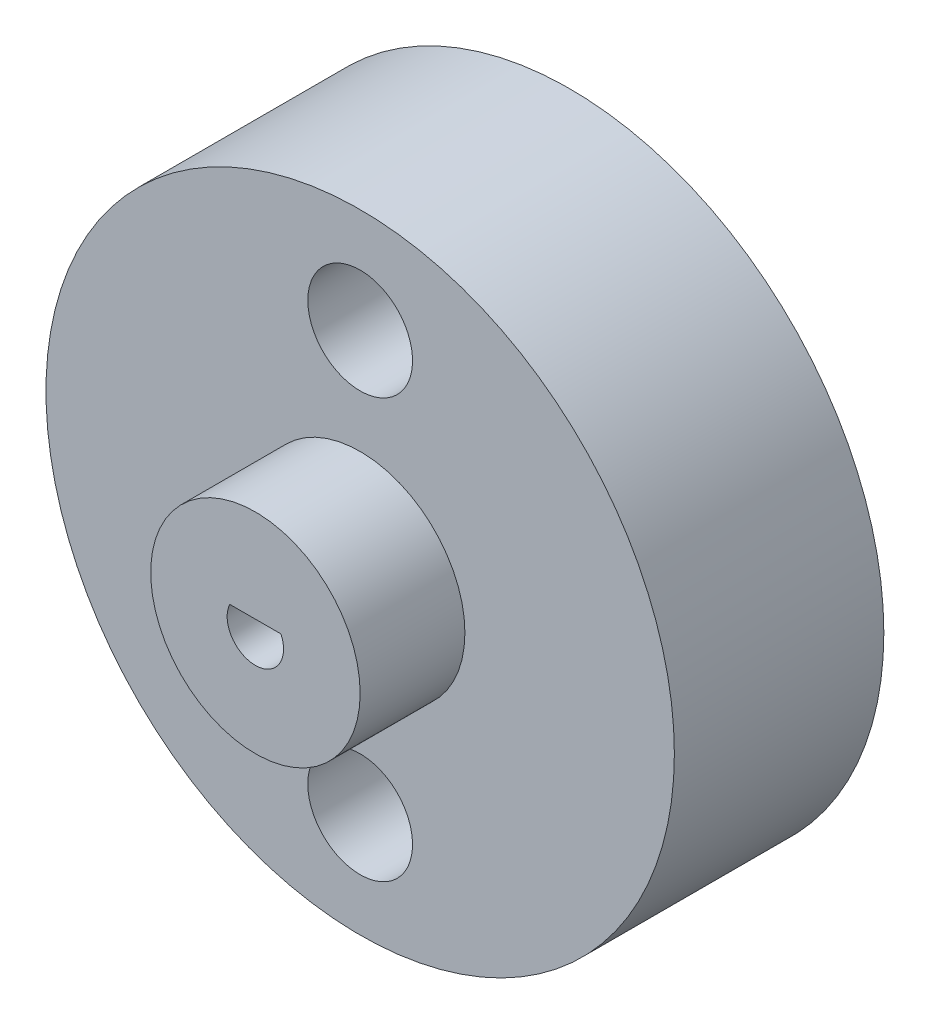
ISO-10303-21;
HEADER;
FILE_DESCRIPTION(('STEP AP214'),'2;1');
FILE_NAME('part.step','',(''),(''),'','','');
FILE_SCHEMA(('AUTOMOTIVE_DESIGN { 1 0 10303 214 1 1 1 1 }'));
ENDSEC;
DATA;
#1=APPLICATION_CONTEXT('core data for automotive mechanical design processes');
#2=APPLICATION_PROTOCOL_DEFINITION('international standard','automotive_design',2000,#1);
#3=PRODUCT_CONTEXT('',#1,'mechanical');
#4=PRODUCT('Part','Part','',(#3));
#5=PRODUCT_RELATED_PRODUCT_CATEGORY('part','',(#4));
#6=PRODUCT_DEFINITION_FORMATION('','',#4);
#7=PRODUCT_DEFINITION_CONTEXT('part definition',#1,'design');
#8=PRODUCT_DEFINITION('design','',#6,#7);
#9=PRODUCT_DEFINITION_SHAPE('','',#8);
#10=(LENGTH_UNIT() NAMED_UNIT(*) SI_UNIT(.MILLI.,.METRE.));
#11=(NAMED_UNIT(*) PLANE_ANGLE_UNIT() SI_UNIT($,.RADIAN.));
#12=(NAMED_UNIT(*) SI_UNIT($,.STERADIAN.) SOLID_ANGLE_UNIT());
#13=UNCERTAINTY_MEASURE_WITH_UNIT(LENGTH_MEASURE(1.E-05),#10,'distance_accuracy_value','');
#14=(GEOMETRIC_REPRESENTATION_CONTEXT(3) GLOBAL_UNCERTAINTY_ASSIGNED_CONTEXT((#13)) GLOBAL_UNIT_ASSIGNED_CONTEXT((#10,
#11,#12)) REPRESENTATION_CONTEXT('',''));
#15=CARTESIAN_POINT('',(0.,0.,0.));
#16=DIRECTION('',(0.,0.,1.));
#17=DIRECTION('',(1.,0.,0.));
#18=AXIS2_PLACEMENT_3D('',#15,#16,#17);
#19=CARTESIAN_POINT('',(0.,0.,12.7));
#20=DIRECTION('',(0.,0.,-1.));
#21=DIRECTION('',(-1.,0.,0.));
#22=AXIS2_PLACEMENT_3D('',#19,#20,#21);
#23=CYLINDRICAL_SURFACE('',#22,19.05);
#24=CARTESIAN_POINT('',(0.,0.,12.7));
#25=DIRECTION('',(0.,0.,1.));
#26=DIRECTION('',(1.,0.,0.));
#27=AXIS2_PLACEMENT_3D('',#24,#25,#26);
#28=CIRCLE('',#27,19.05);
#29=CARTESIAN_POINT('',(19.05,0.,12.7));
#30=VERTEX_POINT('',#29);
#31=EDGE_CURVE('E52',#30,#30,#28,.T.);
#32=ORIENTED_EDGE('',*,*,#31,.F.);
#33=EDGE_LOOP('',(#32));
#34=FACE_BOUND('',#33,.T.);
#35=CARTESIAN_POINT('',(0.,0.,0.));
#36=DIRECTION('',(0.,0.,1.));
#37=DIRECTION('',(1.,0.,0.));
#38=AXIS2_PLACEMENT_3D('',#35,#36,#37);
#39=CIRCLE('',#38,19.05);
#40=CARTESIAN_POINT('',(19.05,0.,0.));
#41=VERTEX_POINT('',#40);
#42=EDGE_CURVE('E47',#41,#41,#39,.T.);
#43=ORIENTED_EDGE('',*,*,#42,.T.);
#44=EDGE_LOOP('',(#43));
#45=FACE_BOUND('',#44,.T.);
#46=ADVANCED_FACE('F44',(#34,#45),#23,.T.);
#47=CARTESIAN_POINT('',(0.,0.,12.7));
#48=DIRECTION('',(0.,0.,1.));
#49=DIRECTION('',(1.,0.,0.));
#50=AXIS2_PLACEMENT_3D('',#47,#48,#49);
#51=PLANE('',#50);
#52=CARTESIAN_POINT('',(0.,0.,12.7));
#53=DIRECTION('',(0.,0.,1.));
#54=DIRECTION('',(1.,0.,0.));
#55=AXIS2_PLACEMENT_3D('',#52,#53,#54);
#56=CIRCLE('',#55,6.35);
#57=CARTESIAN_POINT('',(6.35,0.,12.7));
#58=VERTEX_POINT('',#57);
#59=EDGE_CURVE('E13',#58,#58,#56,.T.);
#60=ORIENTED_EDGE('',*,*,#59,.F.);
#61=EDGE_LOOP('',(#60));
#62=FACE_BOUND('',#61,.T.);
#63=CARTESIAN_POINT('',(0.,12.7,12.7));
#64=DIRECTION('',(0.,0.,-1.));
#65=DIRECTION('',(-1.,0.,0.));
#66=AXIS2_PLACEMENT_3D('',#63,#64,#65);
#67=CIRCLE('',#66,3.175);
#68=CARTESIAN_POINT('',(-3.175,12.7,12.7));
#69=VERTEX_POINT('',#68);
#70=EDGE_CURVE('E95',#69,#69,#67,.T.);
#71=ORIENTED_EDGE('',*,*,#70,.T.);
#72=EDGE_LOOP('',(#71));
#73=FACE_BOUND('',#72,.T.);
#74=CARTESIAN_POINT('',(0.,-12.7,12.7));
#75=DIRECTION('',(0.,0.,-1.));
#76=DIRECTION('',(-1.,0.,0.));
#77=AXIS2_PLACEMENT_3D('',#74,#75,#76);
#78=CIRCLE('',#77,3.175);
#79=CARTESIAN_POINT('',(-3.175,-12.7,12.7));
#80=VERTEX_POINT('',#79);
#81=EDGE_CURVE('E101',#80,#80,#78,.T.);
#82=ORIENTED_EDGE('',*,*,#81,.T.);
#83=EDGE_LOOP('',(#82));
#84=FACE_BOUND('',#83,.T.);
#85=ORIENTED_EDGE('',*,*,#31,.T.);
#86=EDGE_LOOP('',(#85));
#87=FACE_BOUND('',#86,.T.);
#88=ADVANCED_FACE('F115',(#62,#73,#84,#87),#51,.T.);
#89=CARTESIAN_POINT('',(0.,0.,0.));
#90=DIRECTION('',(0.,0.,1.));
#91=DIRECTION('',(1.,0.,0.));
#92=AXIS2_PLACEMENT_3D('',#89,#90,#91);
#93=PLANE('',#92);
#94=CARTESIAN_POINT('',(-0.00553061380337283,-0.00157682925137079,0.));
#95=DIRECTION('',(0.,0.,1.));
#96=DIRECTION('',(1.,0.,0.));
#97=AXIS2_PLACEMENT_3D('',#94,#95,#96);
#98=CIRCLE('',#97,1.71006866326915);
#99=CARTESIAN_POINT('',(-1.55737269811951,0.71683877361406,0.));
#100=VERTEX_POINT('',#99);
#101=CARTESIAN_POINT('',(1.54631147051276,0.71683877361406,0.));
#102=VERTEX_POINT('',#101);
#103=EDGE_CURVE('E78',#100,#102,#98,.T.);
#104=ORIENTED_EDGE('',*,*,#103,.T.);
#105=DIRECTION('',(-1.,0.,0.));
#106=VECTOR('',#105,1.);
#107=CARTESIAN_POINT('',(0.,0.71683877361406,0.));
#108=LINE('',#107,#106);
#109=EDGE_CURVE('E65',#102,#100,#108,.T.);
#110=ORIENTED_EDGE('',*,*,#109,.T.);
#111=EDGE_LOOP('',(#104,#110));
#112=FACE_BOUND('',#111,.T.);
#113=CARTESIAN_POINT('',(0.,12.7,0.));
#114=DIRECTION('',(0.,0.,-1.));
#115=DIRECTION('',(-1.,0.,0.));
#116=AXIS2_PLACEMENT_3D('',#113,#114,#115);
#117=CIRCLE('',#116,3.175);
#118=CARTESIAN_POINT('',(-3.175,12.7,0.));
#119=VERTEX_POINT('',#118);
#120=EDGE_CURVE('E98',#119,#119,#117,.T.);
#121=ORIENTED_EDGE('',*,*,#120,.F.);
#122=EDGE_LOOP('',(#121));
#123=FACE_BOUND('',#122,.T.);
#124=CARTESIAN_POINT('',(0.,-12.7,0.));
#125=DIRECTION('',(0.,0.,-1.));
#126=DIRECTION('',(-1.,0.,0.));
#127=AXIS2_PLACEMENT_3D('',#124,#125,#126);
#128=CIRCLE('',#127,3.175);
#129=CARTESIAN_POINT('',(-3.175,-12.7,0.));
#130=VERTEX_POINT('',#129);
#131=EDGE_CURVE('E94',#130,#130,#128,.T.);
#132=ORIENTED_EDGE('',*,*,#131,.F.);
#133=EDGE_LOOP('',(#132));
#134=FACE_BOUND('',#133,.T.);
#135=ORIENTED_EDGE('',*,*,#42,.F.);
#136=EDGE_LOOP('',(#135));
#137=FACE_BOUND('',#136,.T.);
#138=ADVANCED_FACE('F112',(#112,#123,#134,#137),#93,.F.);
#139=CARTESIAN_POINT('',(0.,-12.7,12.7));
#140=DIRECTION('',(0.,0.,-1.));
#141=DIRECTION('',(-1.,0.,0.));
#142=AXIS2_PLACEMENT_3D('',#139,#140,#141);
#143=CYLINDRICAL_SURFACE('',#142,3.175);
#144=ORIENTED_EDGE('',*,*,#81,.F.);
#145=EDGE_LOOP('',(#144));
#146=FACE_BOUND('',#145,.T.);
#147=ORIENTED_EDGE('',*,*,#131,.T.);
#148=EDGE_LOOP('',(#147));
#149=FACE_BOUND('',#148,.T.);
#150=ADVANCED_FACE('F114',(#146,#149),#143,.F.);
#151=CARTESIAN_POINT('',(0.,12.7,12.7));
#152=DIRECTION('',(0.,0.,-1.));
#153=DIRECTION('',(-1.,0.,0.));
#154=AXIS2_PLACEMENT_3D('',#151,#152,#153);
#155=CYLINDRICAL_SURFACE('',#154,3.175);
#156=ORIENTED_EDGE('',*,*,#70,.F.);
#157=EDGE_LOOP('',(#156));
#158=FACE_BOUND('',#157,.T.);
#159=ORIENTED_EDGE('',*,*,#120,.T.);
#160=EDGE_LOOP('',(#159));
#161=FACE_BOUND('',#160,.T.);
#162=ADVANCED_FACE('F121',(#158,#161),#155,.F.);
#163=CARTESIAN_POINT('',(0.,0.71683877361406,0.));
#164=DIRECTION('',(0.,1.,0.));
#165=DIRECTION('',(0.,0.,1.));
#166=AXIS2_PLACEMENT_3D('',#163,#164,#165);
#167=PLANE('',#166);
#168=DIRECTION('',(0.,0.,1.));
#169=VECTOR('',#168,1.);
#170=CARTESIAN_POINT('',(1.54631147051276,0.71683877361406,0.));
#171=LINE('',#170,#169);
#172=CARTESIAN_POINT('',(1.54631147051276,0.71683877361406,19.05));
#173=VERTEX_POINT('',#172);
#174=EDGE_CURVE('E60',#102,#173,#171,.T.);
#175=ORIENTED_EDGE('',*,*,#174,.T.);
#176=DIRECTION('',(1.,0.,0.));
#177=VECTOR('',#176,1.);
#178=CARTESIAN_POINT('',(1.54631147051276,0.71683877361406,19.05));
#179=LINE('',#178,#177);
#180=CARTESIAN_POINT('',(-1.55737269811951,0.71683877361406,19.05));
#181=VERTEX_POINT('',#180);
#182=EDGE_CURVE('E80',#181,#173,#179,.T.);
#183=ORIENTED_EDGE('',*,*,#182,.F.);
#184=DIRECTION('',(0.,0.,1.));
#185=VECTOR('',#184,1.);
#186=CARTESIAN_POINT('',(-1.55737269811951,0.71683877361406,0.));
#187=LINE('',#186,#185);
#188=EDGE_CURVE('E72',#100,#181,#187,.T.);
#189=ORIENTED_EDGE('',*,*,#188,.F.);
#190=ORIENTED_EDGE('',*,*,#109,.F.);
#191=EDGE_LOOP('',(#175,#183,#189,#190));
#192=FACE_BOUND('',#191,.T.);
#193=ADVANCED_FACE('F81',(#192),#167,.F.);
#194=CARTESIAN_POINT('',(-0.00553061380337283,-0.00157682925137079,0.));
#195=DIRECTION('',(0.,0.,1.));
#196=DIRECTION('',(1.,0.,0.));
#197=AXIS2_PLACEMENT_3D('',#194,#195,#196);
#198=CYLINDRICAL_SURFACE('',#197,1.71006866326915);
#199=ORIENTED_EDGE('',*,*,#188,.T.);
#200=CARTESIAN_POINT('',(-0.00553061380337283,-0.00157682925137079,19.05));
#201=DIRECTION('',(0.,0.,-1.));
#202=DIRECTION('',(-1.,0.,0.));
#203=AXIS2_PLACEMENT_3D('',#200,#201,#202);
#204=CIRCLE('',#203,1.71006866326915);
#205=EDGE_CURVE('E75',#173,#181,#204,.T.);
#206=ORIENTED_EDGE('',*,*,#205,.F.);
#207=ORIENTED_EDGE('',*,*,#174,.F.);
#208=ORIENTED_EDGE('',*,*,#103,.F.);
#209=EDGE_LOOP('',(#199,#206,#207,#208));
#210=FACE_BOUND('',#209,.T.);
#211=ADVANCED_FACE('F73',(#210),#198,.F.);
#212=CARTESIAN_POINT('',(0.,0.,19.05));
#213=DIRECTION('',(0.,0.,1.));
#214=DIRECTION('',(1.,0.,0.));
#215=AXIS2_PLACEMENT_3D('',#212,#213,#214);
#216=PLANE('',#215);
#217=ORIENTED_EDGE('',*,*,#205,.T.);
#218=ORIENTED_EDGE('',*,*,#182,.T.);
#219=EDGE_LOOP('',(#217,#218));
#220=FACE_BOUND('',#219,.T.);
#221=CARTESIAN_POINT('',(0.,0.,19.05));
#222=DIRECTION('',(0.,0.,1.));
#223=DIRECTION('',(1.,0.,0.));
#224=AXIS2_PLACEMENT_3D('',#221,#222,#223);
#225=CIRCLE('',#224,6.35);
#226=CARTESIAN_POINT('',(6.35,0.,19.05));
#227=VERTEX_POINT('',#226);
#228=EDGE_CURVE('E83',#227,#227,#225,.T.);
#229=ORIENTED_EDGE('',*,*,#228,.T.);
#230=EDGE_LOOP('',(#229));
#231=FACE_BOUND('',#230,.T.);
#232=ADVANCED_FACE('F85',(#220,#231),#216,.T.);
#233=CARTESIAN_POINT('',(0.,0.,19.05));
#234=DIRECTION('',(0.,0.,-1.));
#235=DIRECTION('',(-1.,0.,0.));
#236=AXIS2_PLACEMENT_3D('',#233,#234,#235);
#237=CYLINDRICAL_SURFACE('',#236,6.35);
#238=ORIENTED_EDGE('',*,*,#228,.F.);
#239=EDGE_LOOP('',(#238));
#240=FACE_BOUND('',#239,.T.);
#241=ORIENTED_EDGE('',*,*,#59,.T.);
#242=EDGE_LOOP('',(#241));
#243=FACE_BOUND('',#242,.T.);
#244=ADVANCED_FACE('F144',(#240,#243),#237,.T.);
#245=CLOSED_SHELL('',(#46,#88,#138,#150,#162,#193,#211,#232,#244));
#246=MANIFOLD_SOLID_BREP('B2',#245);
#247=ADVANCED_BREP_SHAPE_REPRESENTATION('',(#18,#246),#14);
#248=SHAPE_DEFINITION_REPRESENTATION(#9,#247);
ENDSEC;
END-ISO-10303-21;
